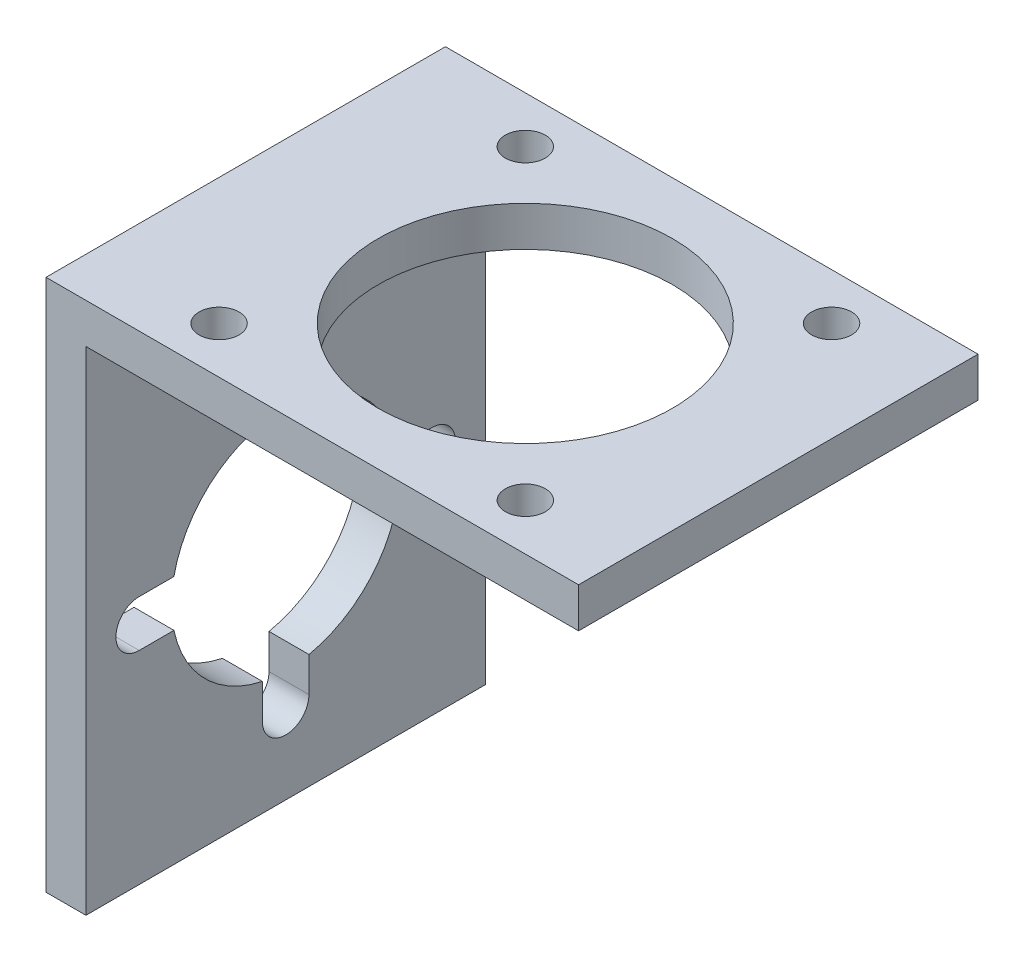
ISO-10303-21;
HEADER;
FILE_DESCRIPTION(('STEP AP214'),'2;1');
FILE_NAME('part.step','',(''),(''),'','','');
FILE_SCHEMA(('AUTOMOTIVE_DESIGN { 1 0 10303 214 1 1 1 1 }'));
ENDSEC;
DATA;
#1=APPLICATION_CONTEXT('core data for automotive mechanical design processes');
#2=APPLICATION_PROTOCOL_DEFINITION('international standard','automotive_design',2000,#1);
#3=PRODUCT_CONTEXT('',#1,'mechanical');
#4=PRODUCT('Part','Part','',(#3));
#5=PRODUCT_RELATED_PRODUCT_CATEGORY('part','',(#4));
#6=PRODUCT_DEFINITION_FORMATION('','',#4);
#7=PRODUCT_DEFINITION_CONTEXT('part definition',#1,'design');
#8=PRODUCT_DEFINITION('design','',#6,#7);
#9=PRODUCT_DEFINITION_SHAPE('','',#8);
#10=(LENGTH_UNIT() NAMED_UNIT(*) SI_UNIT(.MILLI.,.METRE.));
#11=(NAMED_UNIT(*) PLANE_ANGLE_UNIT() SI_UNIT($,.RADIAN.));
#12=(NAMED_UNIT(*) SI_UNIT($,.STERADIAN.) SOLID_ANGLE_UNIT());
#13=UNCERTAINTY_MEASURE_WITH_UNIT(LENGTH_MEASURE(1.E-05),#10,'distance_accuracy_value','');
#14=(GEOMETRIC_REPRESENTATION_CONTEXT(3) GLOBAL_UNCERTAINTY_ASSIGNED_CONTEXT((#13)) GLOBAL_UNIT_ASSIGNED_CONTEXT((#10,
#11,#12)) REPRESENTATION_CONTEXT('',''));
#15=CARTESIAN_POINT('',(0.,0.,0.));
#16=DIRECTION('',(0.,0.,1.));
#17=DIRECTION('',(1.,0.,0.));
#18=AXIS2_PLACEMENT_3D('',#15,#16,#17);
#19=CARTESIAN_POINT('',(0.,-3.,30.));
#20=DIRECTION('',(1.,0.,0.));
#21=DIRECTION('',(0.,1.,0.));
#22=AXIS2_PLACEMENT_3D('',#19,#20,#21);
#23=PLANE('',#22);
#24=DIRECTION('',(0.,0.,1.));
#25=VECTOR('',#24,1.);
#26=CARTESIAN_POINT('',(0.,-21.27,26.));
#27=LINE('',#26,#25);
#28=CARTESIAN_POINT('',(0.,-21.27,23.3894219109543));
#29=VERTEX_POINT('',#28);
#30=CARTESIAN_POINT('',(0.,-21.27,26.));
#31=VERTEX_POINT('',#30);
#32=EDGE_CURVE('E188',#29,#31,#27,.T.);
#33=ORIENTED_EDGE('',*,*,#32,.T.);
#34=CARTESIAN_POINT('',(0.,-23.02,26.));
#35=DIRECTION('',(1.,0.,0.));
#36=DIRECTION('',(0.,1.,0.));
#37=AXIS2_PLACEMENT_3D('',#34,#35,#36);
#38=CIRCLE('',#37,1.75);
#39=CARTESIAN_POINT('',(0.,-24.77,26.));
#40=VERTEX_POINT('',#39);
#41=EDGE_CURVE('E182',#31,#40,#38,.T.);
#42=ORIENTED_EDGE('',*,*,#41,.T.);
#43=DIRECTION('',(0.,0.,-1.));
#44=VECTOR('',#43,1.);
#45=CARTESIAN_POINT('',(0.,-24.77,26.));
#46=LINE('',#45,#44);
#47=CARTESIAN_POINT('',(0.,-24.77,23.3894219109543));
#48=VERTEX_POINT('',#47);
#49=EDGE_CURVE('E191',#40,#48,#46,.T.);
#50=ORIENTED_EDGE('',*,*,#49,.T.);
#51=CARTESIAN_POINT('',(0.,-23.02,15.));
#52=DIRECTION('',(1.,0.,0.));
#53=DIRECTION('',(0.,1.,0.));
#54=AXIS2_PLACEMENT_3D('',#51,#52,#53);
#55=CIRCLE('',#54,8.57);
#56=CARTESIAN_POINT('',(0.,-31.4094219109543,16.7499999999999));
#57=VERTEX_POINT('',#56);
#58=EDGE_CURVE('E46',#48,#57,#55,.T.);
#59=ORIENTED_EDGE('',*,*,#58,.T.);
#60=DIRECTION('',(0.,-1.,0.));
#61=VECTOR('',#60,1.);
#62=CARTESIAN_POINT('',(0.,-34.02,16.75));
#63=LINE('',#62,#61);
#64=CARTESIAN_POINT('',(0.,-34.02,16.75));
#65=VERTEX_POINT('',#64);
#66=EDGE_CURVE('E205',#57,#65,#63,.T.);
#67=ORIENTED_EDGE('',*,*,#66,.T.);
#68=CARTESIAN_POINT('',(0.,-34.02,15.));
#69=DIRECTION('',(1.,0.,0.));
#70=DIRECTION('',(0.,1.,0.));
#71=AXIS2_PLACEMENT_3D('',#68,#69,#70);
#72=CIRCLE('',#71,1.75);
#73=CARTESIAN_POINT('',(0.,-34.02,13.25));
#74=VERTEX_POINT('',#73);
#75=EDGE_CURVE('E208',#65,#74,#72,.T.);
#76=ORIENTED_EDGE('',*,*,#75,.T.);
#77=DIRECTION('',(0.,1.,0.));
#78=VECTOR('',#77,1.);
#79=CARTESIAN_POINT('',(0.,-34.02,13.25));
#80=LINE('',#79,#78);
#81=CARTESIAN_POINT('',(0.,-31.4094219109543,13.2499999999999));
#82=VERTEX_POINT('',#81);
#83=EDGE_CURVE('E211',#74,#82,#80,.T.);
#84=ORIENTED_EDGE('',*,*,#83,.T.);
#85=CARTESIAN_POINT('',(0.,-23.02,15.));
#86=DIRECTION('',(1.,0.,0.));
#87=DIRECTION('',(0.,1.,0.));
#88=AXIS2_PLACEMENT_3D('',#85,#86,#87);
#89=CIRCLE('',#88,8.57);
#90=CARTESIAN_POINT('',(0.,-24.77,6.6105780890457));
#91=VERTEX_POINT('',#90);
#92=EDGE_CURVE('E214',#82,#91,#89,.T.);
#93=ORIENTED_EDGE('',*,*,#92,.T.);
#94=DIRECTION('',(0.,0.,-1.));
#95=VECTOR('',#94,1.);
#96=CARTESIAN_POINT('',(0.,-24.7700000000001,4.00000000000001));
#97=LINE('',#96,#95);
#98=CARTESIAN_POINT('',(0.,-24.7700000000001,4.00000000000001));
#99=VERTEX_POINT('',#98);
#100=EDGE_CURVE('E217',#91,#99,#97,.T.);
#101=ORIENTED_EDGE('',*,*,#100,.T.);
#102=CARTESIAN_POINT('',(0.,-23.0200000000001,4.00000000000001));
#103=DIRECTION('',(1.,0.,0.));
#104=DIRECTION('',(0.,1.,0.));
#105=AXIS2_PLACEMENT_3D('',#102,#103,#104);
#106=CIRCLE('',#105,1.75);
#107=CARTESIAN_POINT('',(0.,-21.2700000000001,4.00000000000001));
#108=VERTEX_POINT('',#107);
#109=EDGE_CURVE('E220',#99,#108,#106,.T.);
#110=ORIENTED_EDGE('',*,*,#109,.T.);
#111=DIRECTION('',(0.,0.,1.));
#112=VECTOR('',#111,1.);
#113=CARTESIAN_POINT('',(0.,-21.2700000000001,4.00000000000001));
#114=LINE('',#113,#112);
#115=CARTESIAN_POINT('',(0.,-21.27,6.61057808904571));
#116=VERTEX_POINT('',#115);
#117=EDGE_CURVE('E223',#108,#116,#114,.T.);
#118=ORIENTED_EDGE('',*,*,#117,.T.);
#119=CARTESIAN_POINT('',(0.,-23.02,15.));
#120=DIRECTION('',(1.,0.,0.));
#121=DIRECTION('',(0.,1.,0.));
#122=AXIS2_PLACEMENT_3D('',#119,#120,#121);
#123=CIRCLE('',#122,8.57);
#124=CARTESIAN_POINT('',(0.,-14.6305780890457,13.2499999999999));
#125=VERTEX_POINT('',#124);
#126=EDGE_CURVE('E226',#116,#125,#123,.T.);
#127=ORIENTED_EDGE('',*,*,#126,.T.);
#128=DIRECTION('',(0.,1.,0.));
#129=VECTOR('',#128,1.);
#130=CARTESIAN_POINT('',(0.,-12.02,13.2499999999999));
#131=LINE('',#130,#129);
#132=CARTESIAN_POINT('',(0.,-12.02,13.2499999999999));
#133=VERTEX_POINT('',#132);
#134=EDGE_CURVE('E229',#125,#133,#131,.T.);
#135=ORIENTED_EDGE('',*,*,#134,.T.);
#136=CARTESIAN_POINT('',(0.,-12.02,14.9999999999999));
#137=DIRECTION('',(1.,0.,0.));
#138=DIRECTION('',(0.,1.,0.));
#139=AXIS2_PLACEMENT_3D('',#136,#137,#138);
#140=CIRCLE('',#139,1.75);
#141=CARTESIAN_POINT('',(0.,-12.02,16.7499999999999));
#142=VERTEX_POINT('',#141);
#143=EDGE_CURVE('E232',#133,#142,#140,.T.);
#144=ORIENTED_EDGE('',*,*,#143,.T.);
#145=DIRECTION('',(0.,-1.,0.));
#146=VECTOR('',#145,1.);
#147=CARTESIAN_POINT('',(0.,-12.02,16.7499999999999));
#148=LINE('',#147,#146);
#149=CARTESIAN_POINT('',(0.,-14.6305780890457,16.7499999999999));
#150=VERTEX_POINT('',#149);
#151=EDGE_CURVE('E235',#142,#150,#148,.T.);
#152=ORIENTED_EDGE('',*,*,#151,.T.);
#153=CARTESIAN_POINT('',(0.,-23.02,15.));
#154=DIRECTION('',(1.,0.,0.));
#155=DIRECTION('',(0.,1.,0.));
#156=AXIS2_PLACEMENT_3D('',#153,#154,#155);
#157=CIRCLE('',#156,8.57);
#158=EDGE_CURVE('E238',#150,#29,#157,.T.);
#159=ORIENTED_EDGE('',*,*,#158,.T.);
#160=EDGE_LOOP('',(#33,#42,#50,#59,#67,#76,#84,#93,#101,#110,#118,#127,#135,#144,#152,#159));
#161=FACE_BOUND('',#160,.T.);
#162=DIRECTION('',(0.,-1.,0.));
#163=VECTOR('',#162,1.);
#164=CARTESIAN_POINT('',(0.,-3.,0.));
#165=LINE('',#164,#163);
#166=CARTESIAN_POINT('',(0.,0.,0.));
#167=VERTEX_POINT('',#166);
#168=CARTESIAN_POINT('',(0.,-40.,0.));
#169=VERTEX_POINT('',#168);
#170=EDGE_CURVE('E339',#167,#169,#165,.T.);
#171=ORIENTED_EDGE('',*,*,#170,.T.);
#172=DIRECTION('',(0.,0.,-1.));
#173=VECTOR('',#172,1.);
#174=CARTESIAN_POINT('',(0.,-40.,30.));
#175=LINE('',#174,#173);
#176=CARTESIAN_POINT('',(0.,-40.,30.));
#177=VERTEX_POINT('',#176);
#178=EDGE_CURVE('E11',#177,#169,#175,.T.);
#179=ORIENTED_EDGE('',*,*,#178,.F.);
#180=DIRECTION('',(0.,-1.,0.));
#181=VECTOR('',#180,1.);
#182=CARTESIAN_POINT('',(0.,0.,30.));
#183=LINE('',#182,#181);
#184=CARTESIAN_POINT('',(0.,0.,30.));
#185=VERTEX_POINT('',#184);
#186=EDGE_CURVE('E342',#185,#177,#183,.T.);
#187=ORIENTED_EDGE('',*,*,#186,.F.);
#188=DIRECTION('',(0.,0.,-1.));
#189=VECTOR('',#188,1.);
#190=CARTESIAN_POINT('',(0.,0.,30.));
#191=LINE('',#190,#189);
#192=EDGE_CURVE('E355',#185,#167,#191,.T.);
#193=ORIENTED_EDGE('',*,*,#192,.T.);
#194=EDGE_LOOP('',(#171,#179,#187,#193));
#195=FACE_BOUND('',#194,.T.);
#196=ADVANCED_FACE('F32',(#161,#195),#23,.F.);
#197=CARTESIAN_POINT('',(0.,-40.,30.));
#198=DIRECTION('',(0.,1.,0.));
#199=DIRECTION('',(0.,0.,1.));
#200=AXIS2_PLACEMENT_3D('',#197,#198,#199);
#201=PLANE('',#200);
#202=DIRECTION('',(1.,0.,0.));
#203=VECTOR('',#202,1.);
#204=CARTESIAN_POINT('',(0.,-40.,0.));
#205=LINE('',#204,#203);
#206=CARTESIAN_POINT('',(3.00000000000001,-40.,0.));
#207=VERTEX_POINT('',#206);
#208=EDGE_CURVE('E357',#169,#207,#205,.T.);
#209=ORIENTED_EDGE('',*,*,#208,.T.);
#210=DIRECTION('',(0.,0.,-1.));
#211=VECTOR('',#210,1.);
#212=CARTESIAN_POINT('',(3.00000000000001,-40.,30.));
#213=LINE('',#212,#211);
#214=CARTESIAN_POINT('',(3.00000000000001,-40.,30.));
#215=VERTEX_POINT('',#214);
#216=EDGE_CURVE('E39',#215,#207,#213,.T.);
#217=ORIENTED_EDGE('',*,*,#216,.F.);
#218=DIRECTION('',(1.,0.,0.));
#219=VECTOR('',#218,1.);
#220=CARTESIAN_POINT('',(0.,-40.,30.));
#221=LINE('',#220,#219);
#222=EDGE_CURVE('E344',#177,#215,#221,.T.);
#223=ORIENTED_EDGE('',*,*,#222,.F.);
#224=ORIENTED_EDGE('',*,*,#178,.T.);
#225=EDGE_LOOP('',(#209,#217,#223,#224));
#226=FACE_BOUND('',#225,.T.);
#227=ADVANCED_FACE('F406',(#226),#201,.F.);
#228=CARTESIAN_POINT('',(3.,-3.,30.));
#229=DIRECTION('',(-1.,0.,0.));
#230=DIRECTION('',(0.,-1.,0.));
#231=AXIS2_PLACEMENT_3D('',#228,#229,#230);
#232=PLANE('',#231);
#233=DIRECTION('',(0.,0.,-1.));
#234=VECTOR('',#233,1.);
#235=CARTESIAN_POINT('',(3.,-24.77,26.));
#236=LINE('',#235,#234);
#237=CARTESIAN_POINT('',(3.,-24.77,26.));
#238=VERTEX_POINT('',#237);
#239=CARTESIAN_POINT('',(3.,-24.77,23.3894219109543));
#240=VERTEX_POINT('',#239);
#241=EDGE_CURVE('E242',#238,#240,#236,.T.);
#242=ORIENTED_EDGE('',*,*,#241,.F.);
#243=CARTESIAN_POINT('',(3.,-23.02,26.));
#244=DIRECTION('',(1.,0.,0.));
#245=DIRECTION('',(0.,1.,0.));
#246=AXIS2_PLACEMENT_3D('',#243,#244,#245);
#247=CIRCLE('',#246,1.75);
#248=CARTESIAN_POINT('',(3.,-21.27,26.));
#249=VERTEX_POINT('',#248);
#250=EDGE_CURVE('E54',#249,#238,#247,.T.);
#251=ORIENTED_EDGE('',*,*,#250,.F.);
#252=DIRECTION('',(0.,0.,1.));
#253=VECTOR('',#252,1.);
#254=CARTESIAN_POINT('',(3.,-21.27,26.));
#255=LINE('',#254,#253);
#256=CARTESIAN_POINT('',(3.,-21.27,23.3894219109543));
#257=VERTEX_POINT('',#256);
#258=EDGE_CURVE('E198',#257,#249,#255,.T.);
#259=ORIENTED_EDGE('',*,*,#258,.F.);
#260=CARTESIAN_POINT('',(3.,-23.02,15.));
#261=DIRECTION('',(1.,0.,0.));
#262=DIRECTION('',(0.,1.,0.));
#263=AXIS2_PLACEMENT_3D('',#260,#261,#262);
#264=CIRCLE('',#263,8.57);
#265=CARTESIAN_POINT('',(3.,-14.6305780890457,16.7499999999999));
#266=VERTEX_POINT('',#265);
#267=EDGE_CURVE('E201',#266,#257,#264,.T.);
#268=ORIENTED_EDGE('',*,*,#267,.F.);
#269=DIRECTION('',(0.,-1.,0.));
#270=VECTOR('',#269,1.);
#271=CARTESIAN_POINT('',(3.,-12.02,16.7499999999999));
#272=LINE('',#271,#270);
#273=CARTESIAN_POINT('',(3.,-12.02,16.7499999999999));
#274=VERTEX_POINT('',#273);
#275=EDGE_CURVE('E277',#274,#266,#272,.T.);
#276=ORIENTED_EDGE('',*,*,#275,.F.);
#277=CARTESIAN_POINT('',(3.,-12.02,14.9999999999999));
#278=DIRECTION('',(1.,0.,0.));
#279=DIRECTION('',(0.,1.,0.));
#280=AXIS2_PLACEMENT_3D('',#277,#278,#279);
#281=CIRCLE('',#280,1.75);
#282=CARTESIAN_POINT('',(3.,-12.02,13.2499999999999));
#283=VERTEX_POINT('',#282);
#284=EDGE_CURVE('E274',#283,#274,#281,.T.);
#285=ORIENTED_EDGE('',*,*,#284,.F.);
#286=DIRECTION('',(0.,1.,0.));
#287=VECTOR('',#286,1.);
#288=CARTESIAN_POINT('',(3.,-12.02,13.2499999999999));
#289=LINE('',#288,#287);
#290=CARTESIAN_POINT('',(3.,-14.6305780890457,13.2499999999999));
#291=VERTEX_POINT('',#290);
#292=EDGE_CURVE('E271',#291,#283,#289,.T.);
#293=ORIENTED_EDGE('',*,*,#292,.F.);
#294=CARTESIAN_POINT('',(3.,-23.02,15.));
#295=DIRECTION('',(1.,0.,0.));
#296=DIRECTION('',(0.,1.,0.));
#297=AXIS2_PLACEMENT_3D('',#294,#295,#296);
#298=CIRCLE('',#297,8.57);
#299=CARTESIAN_POINT('',(3.,-21.27,6.61057808904571));
#300=VERTEX_POINT('',#299);
#301=EDGE_CURVE('E268',#300,#291,#298,.T.);
#302=ORIENTED_EDGE('',*,*,#301,.F.);
#303=DIRECTION('',(0.,0.,1.));
#304=VECTOR('',#303,1.);
#305=CARTESIAN_POINT('',(3.,-21.2700000000001,4.00000000000001));
#306=LINE('',#305,#304);
#307=CARTESIAN_POINT('',(3.,-21.2700000000001,4.00000000000001));
#308=VERTEX_POINT('',#307);
#309=EDGE_CURVE('E265',#308,#300,#306,.T.);
#310=ORIENTED_EDGE('',*,*,#309,.F.);
#311=CARTESIAN_POINT('',(3.,-23.0200000000001,4.00000000000001));
#312=DIRECTION('',(1.,0.,0.));
#313=DIRECTION('',(0.,1.,0.));
#314=AXIS2_PLACEMENT_3D('',#311,#312,#313);
#315=CIRCLE('',#314,1.75);
#316=CARTESIAN_POINT('',(3.,-24.7700000000001,4.00000000000001));
#317=VERTEX_POINT('',#316);
#318=EDGE_CURVE('E262',#317,#308,#315,.T.);
#319=ORIENTED_EDGE('',*,*,#318,.F.);
#320=DIRECTION('',(0.,0.,-1.));
#321=VECTOR('',#320,1.);
#322=CARTESIAN_POINT('',(3.,-24.7700000000001,4.00000000000001));
#323=LINE('',#322,#321);
#324=CARTESIAN_POINT('',(3.,-24.77,6.6105780890457));
#325=VERTEX_POINT('',#324);
#326=EDGE_CURVE('E259',#325,#317,#323,.T.);
#327=ORIENTED_EDGE('',*,*,#326,.F.);
#328=CARTESIAN_POINT('',(3.,-23.02,15.));
#329=DIRECTION('',(1.,0.,0.));
#330=DIRECTION('',(0.,1.,0.));
#331=AXIS2_PLACEMENT_3D('',#328,#329,#330);
#332=CIRCLE('',#331,8.57);
#333=CARTESIAN_POINT('',(3.,-31.4094219109543,13.2499999999999));
#334=VERTEX_POINT('',#333);
#335=EDGE_CURVE('E256',#334,#325,#332,.T.);
#336=ORIENTED_EDGE('',*,*,#335,.F.);
#337=DIRECTION('',(0.,1.,0.));
#338=VECTOR('',#337,1.);
#339=CARTESIAN_POINT('',(3.,-34.02,13.25));
#340=LINE('',#339,#338);
#341=CARTESIAN_POINT('',(3.,-34.02,13.25));
#342=VERTEX_POINT('',#341);
#343=EDGE_CURVE('E253',#342,#334,#340,.T.);
#344=ORIENTED_EDGE('',*,*,#343,.F.);
#345=CARTESIAN_POINT('',(3.,-34.02,15.));
#346=DIRECTION('',(1.,0.,0.));
#347=DIRECTION('',(0.,1.,0.));
#348=AXIS2_PLACEMENT_3D('',#345,#346,#347);
#349=CIRCLE('',#348,1.75);
#350=CARTESIAN_POINT('',(3.,-34.02,16.75));
#351=VERTEX_POINT('',#350);
#352=EDGE_CURVE('E250',#351,#342,#349,.T.);
#353=ORIENTED_EDGE('',*,*,#352,.F.);
#354=DIRECTION('',(0.,-1.,0.));
#355=VECTOR('',#354,1.);
#356=CARTESIAN_POINT('',(3.,-34.02,16.75));
#357=LINE('',#356,#355);
#358=CARTESIAN_POINT('',(3.,-31.4094219109543,16.7499999999999));
#359=VERTEX_POINT('',#358);
#360=EDGE_CURVE('E247',#359,#351,#357,.T.);
#361=ORIENTED_EDGE('',*,*,#360,.F.);
#362=CARTESIAN_POINT('',(3.,-23.02,15.));
#363=DIRECTION('',(1.,0.,0.));
#364=DIRECTION('',(0.,1.,0.));
#365=AXIS2_PLACEMENT_3D('',#362,#363,#364);
#366=CIRCLE('',#365,8.57);
#367=EDGE_CURVE('E244',#240,#359,#366,.T.);
#368=ORIENTED_EDGE('',*,*,#367,.F.);
#369=EDGE_LOOP('',(#242,#251,#259,#268,#276,#285,#293,#302,#310,#319,#327,#336,#344,#353,#361,#368));
#370=FACE_BOUND('',#369,.T.);
#371=DIRECTION('',(0.,1.,0.));
#372=VECTOR('',#371,1.);
#373=CARTESIAN_POINT('',(3.,-3.,0.));
#374=LINE('',#373,#372);
#375=CARTESIAN_POINT('',(3.,-3.,0.));
#376=VERTEX_POINT('',#375);
#377=EDGE_CURVE('E359',#207,#376,#374,.T.);
#378=ORIENTED_EDGE('',*,*,#377,.T.);
#379=DIRECTION('',(0.,0.,-1.));
#380=VECTOR('',#379,1.);
#381=CARTESIAN_POINT('',(3.,-3.,30.));
#382=LINE('',#381,#380);
#383=CARTESIAN_POINT('',(3.,-3.,30.));
#384=VERTEX_POINT('',#383);
#385=EDGE_CURVE('E375',#384,#376,#382,.T.);
#386=ORIENTED_EDGE('',*,*,#385,.F.);
#387=DIRECTION('',(0.,1.,0.));
#388=VECTOR('',#387,1.);
#389=CARTESIAN_POINT('',(3.,-3.,30.));
#390=LINE('',#389,#388);
#391=EDGE_CURVE('E347',#215,#384,#390,.T.);
#392=ORIENTED_EDGE('',*,*,#391,.F.);
#393=ORIENTED_EDGE('',*,*,#216,.T.);
#394=EDGE_LOOP('',(#378,#386,#392,#393));
#395=FACE_BOUND('',#394,.T.);
#396=ADVANCED_FACE('F382',(#370,#395),#232,.F.);
#397=CARTESIAN_POINT('',(3.,-3.,30.));
#398=DIRECTION('',(0.,1.,0.));
#399=DIRECTION('',(0.,0.,1.));
#400=AXIS2_PLACEMENT_3D('',#397,#398,#399);
#401=PLANE('',#400);
#402=CARTESIAN_POINT('',(9.50000000000012,-3.,26.5021834883641));
#403=DIRECTION('',(0.,-1.,0.));
#404=DIRECTION('',(0.,0.,-1.));
#405=AXIS2_PLACEMENT_3D('',#402,#403,#404);
#406=CIRCLE('',#405,1.50000000000001);
#407=CARTESIAN_POINT('',(9.50000000000012,-3.,25.0021834883641));
#408=VERTEX_POINT('',#407);
#409=EDGE_CURVE('E284',#408,#408,#406,.T.);
#410=ORIENTED_EDGE('',*,*,#409,.F.);
#411=EDGE_LOOP('',(#410));
#412=FACE_BOUND('',#411,.T.);
#413=CARTESIAN_POINT('',(9.49781651163593,-3.,3.49999999999975));
#414=DIRECTION('',(0.,-1.,0.));
#415=DIRECTION('',(0.,0.,-1.));
#416=AXIS2_PLACEMENT_3D('',#413,#414,#415);
#417=CIRCLE('',#416,1.5);
#418=CARTESIAN_POINT('',(9.49781651163593,-3.,1.99999999999975));
#419=VERTEX_POINT('',#418);
#420=EDGE_CURVE('E315',#419,#419,#417,.T.);
#421=ORIENTED_EDGE('',*,*,#420,.F.);
#422=EDGE_LOOP('',(#421));
#423=FACE_BOUND('',#422,.T.);
#424=CARTESIAN_POINT('',(32.5000000000003,-3.,3.49781651163567));
#425=DIRECTION('',(0.,-1.,0.));
#426=DIRECTION('',(0.,0.,-1.));
#427=AXIS2_PLACEMENT_3D('',#424,#425,#426);
#428=CIRCLE('',#427,1.50000000000001);
#429=CARTESIAN_POINT('',(32.5000000000003,-3.,1.99781651163566));
#430=VERTEX_POINT('',#429);
#431=EDGE_CURVE('E321',#430,#430,#428,.T.);
#432=ORIENTED_EDGE('',*,*,#431,.F.);
#433=EDGE_LOOP('',(#432));
#434=FACE_BOUND('',#433,.T.);
#435=CARTESIAN_POINT('',(32.5021834883643,-3.,26.5));
#436=DIRECTION('',(0.,-1.,0.));
#437=DIRECTION('',(0.,0.,-1.));
#438=AXIS2_PLACEMENT_3D('',#435,#436,#437);
#439=CIRCLE('',#438,1.5);
#440=CARTESIAN_POINT('',(32.5021834883643,-3.,25.));
#441=VERTEX_POINT('',#440);
#442=EDGE_CURVE('E327',#441,#441,#439,.T.);
#443=ORIENTED_EDGE('',*,*,#442,.F.);
#444=EDGE_LOOP('',(#443));
#445=FACE_BOUND('',#444,.T.);
#446=CARTESIAN_POINT('',(21.,-3.,15.));
#447=DIRECTION('',(0.,-1.,0.));
#448=DIRECTION('',(0.,0.,-1.));
#449=AXIS2_PLACEMENT_3D('',#446,#447,#448);
#450=CIRCLE('',#449,11.05);
#451=CARTESIAN_POINT('',(21.,-3.,3.95));
#452=VERTEX_POINT('',#451);
#453=EDGE_CURVE('E333',#452,#452,#450,.T.);
#454=ORIENTED_EDGE('',*,*,#453,.F.);
#455=EDGE_LOOP('',(#454));
#456=FACE_BOUND('',#455,.T.);
#457=DIRECTION('',(1.,0.,0.));
#458=VECTOR('',#457,1.);
#459=CARTESIAN_POINT('',(3.,-3.,0.));
#460=LINE('',#459,#458);
#461=CARTESIAN_POINT('',(40.,-3.,0.));
#462=VERTEX_POINT('',#461);
#463=EDGE_CURVE('E361',#376,#462,#460,.T.);
#464=ORIENTED_EDGE('',*,*,#463,.T.);
#465=DIRECTION('',(0.,0.,-1.));
#466=VECTOR('',#465,1.);
#467=CARTESIAN_POINT('',(40.,-3.,30.));
#468=LINE('',#467,#466);
#469=CARTESIAN_POINT('',(40.,-3.,30.));
#470=VERTEX_POINT('',#469);
#471=EDGE_CURVE('E372',#470,#462,#468,.T.);
#472=ORIENTED_EDGE('',*,*,#471,.F.);
#473=DIRECTION('',(1.,0.,0.));
#474=VECTOR('',#473,1.);
#475=CARTESIAN_POINT('',(3.,-3.,30.));
#476=LINE('',#475,#474);
#477=EDGE_CURVE('E349',#384,#470,#476,.T.);
#478=ORIENTED_EDGE('',*,*,#477,.F.);
#479=ORIENTED_EDGE('',*,*,#385,.T.);
#480=EDGE_LOOP('',(#464,#472,#478,#479));
#481=FACE_BOUND('',#480,.T.);
#482=ADVANCED_FACE('F394',(#412,#423,#434,#445,#456,#481),#401,.F.);
#483=CARTESIAN_POINT('',(40.,0.,30.));
#484=DIRECTION('',(-1.,0.,0.));
#485=DIRECTION('',(0.,0.,1.));
#486=AXIS2_PLACEMENT_3D('',#483,#484,#485);
#487=PLANE('',#486);
#488=DIRECTION('',(0.,1.,0.));
#489=VECTOR('',#488,1.);
#490=CARTESIAN_POINT('',(40.,0.,0.));
#491=LINE('',#490,#489);
#492=CARTESIAN_POINT('',(40.,0.,0.));
#493=VERTEX_POINT('',#492);
#494=EDGE_CURVE('E363',#462,#493,#491,.T.);
#495=ORIENTED_EDGE('',*,*,#494,.T.);
#496=DIRECTION('',(0.,0.,-1.));
#497=VECTOR('',#496,1.);
#498=CARTESIAN_POINT('',(40.,0.,30.));
#499=LINE('',#498,#497);
#500=CARTESIAN_POINT('',(40.,0.,30.));
#501=VERTEX_POINT('',#500);
#502=EDGE_CURVE('E369',#501,#493,#499,.T.);
#503=ORIENTED_EDGE('',*,*,#502,.F.);
#504=DIRECTION('',(0.,1.,0.));
#505=VECTOR('',#504,1.);
#506=CARTESIAN_POINT('',(40.,0.,30.));
#507=LINE('',#506,#505);
#508=EDGE_CURVE('E351',#470,#501,#507,.T.);
#509=ORIENTED_EDGE('',*,*,#508,.F.);
#510=ORIENTED_EDGE('',*,*,#471,.T.);
#511=EDGE_LOOP('',(#495,#503,#509,#510));
#512=FACE_BOUND('',#511,.T.);
#513=ADVANCED_FACE('F398',(#512),#487,.F.);
#514=CARTESIAN_POINT('',(0.,0.,30.));
#515=DIRECTION('',(0.,-1.,0.));
#516=DIRECTION('',(0.,0.,-1.));
#517=AXIS2_PLACEMENT_3D('',#514,#515,#516);
#518=PLANE('',#517);
#519=CARTESIAN_POINT('',(9.50000000000012,0.,26.5021834883641));
#520=DIRECTION('',(0.,-1.,0.));
#521=DIRECTION('',(0.,0.,-1.));
#522=AXIS2_PLACEMENT_3D('',#519,#520,#521);
#523=CIRCLE('',#522,1.50000000000001);
#524=CARTESIAN_POINT('',(9.50000000000012,0.,25.0021834883641));
#525=VERTEX_POINT('',#524);
#526=EDGE_CURVE('E312',#525,#525,#523,.T.);
#527=ORIENTED_EDGE('',*,*,#526,.T.);
#528=EDGE_LOOP('',(#527));
#529=FACE_BOUND('',#528,.T.);
#530=CARTESIAN_POINT('',(9.49781651163593,0.,3.49999999999975));
#531=DIRECTION('',(0.,-1.,0.));
#532=DIRECTION('',(0.,0.,-1.));
#533=AXIS2_PLACEMENT_3D('',#530,#531,#532);
#534=CIRCLE('',#533,1.5);
#535=CARTESIAN_POINT('',(9.49781651163593,0.,1.99999999999975));
#536=VERTEX_POINT('',#535);
#537=EDGE_CURVE('E318',#536,#536,#534,.T.);
#538=ORIENTED_EDGE('',*,*,#537,.T.);
#539=EDGE_LOOP('',(#538));
#540=FACE_BOUND('',#539,.T.);
#541=CARTESIAN_POINT('',(32.5000000000003,0.,3.49781651163567));
#542=DIRECTION('',(0.,-1.,0.));
#543=DIRECTION('',(0.,0.,-1.));
#544=AXIS2_PLACEMENT_3D('',#541,#542,#543);
#545=CIRCLE('',#544,1.50000000000001);
#546=CARTESIAN_POINT('',(32.5000000000003,0.,1.99781651163566));
#547=VERTEX_POINT('',#546);
#548=EDGE_CURVE('E324',#547,#547,#545,.T.);
#549=ORIENTED_EDGE('',*,*,#548,.T.);
#550=EDGE_LOOP('',(#549));
#551=FACE_BOUND('',#550,.T.);
#552=CARTESIAN_POINT('',(32.5021834883643,0.,26.5));
#553=DIRECTION('',(0.,-1.,0.));
#554=DIRECTION('',(0.,0.,-1.));
#555=AXIS2_PLACEMENT_3D('',#552,#553,#554);
#556=CIRCLE('',#555,1.5);
#557=CARTESIAN_POINT('',(32.5021834883643,0.,25.));
#558=VERTEX_POINT('',#557);
#559=EDGE_CURVE('E330',#558,#558,#556,.T.);
#560=ORIENTED_EDGE('',*,*,#559,.T.);
#561=EDGE_LOOP('',(#560));
#562=FACE_BOUND('',#561,.T.);
#563=CARTESIAN_POINT('',(21.,0.,15.));
#564=DIRECTION('',(0.,-1.,0.));
#565=DIRECTION('',(0.,0.,-1.));
#566=AXIS2_PLACEMENT_3D('',#563,#564,#565);
#567=CIRCLE('',#566,11.05);
#568=CARTESIAN_POINT('',(21.,0.,3.95));
#569=VERTEX_POINT('',#568);
#570=EDGE_CURVE('E336',#569,#569,#567,.T.);
#571=ORIENTED_EDGE('',*,*,#570,.T.);
#572=EDGE_LOOP('',(#571));
#573=FACE_BOUND('',#572,.T.);
#574=DIRECTION('',(-1.,0.,0.));
#575=VECTOR('',#574,1.);
#576=CARTESIAN_POINT('',(0.,0.,0.));
#577=LINE('',#576,#575);
#578=EDGE_CURVE('E345',#493,#167,#577,.T.);
#579=ORIENTED_EDGE('',*,*,#578,.T.);
#580=ORIENTED_EDGE('',*,*,#192,.F.);
#581=DIRECTION('',(-1.,0.,0.));
#582=VECTOR('',#581,1.);
#583=CARTESIAN_POINT('',(0.,0.,30.));
#584=LINE('',#583,#582);
#585=EDGE_CURVE('E353',#501,#185,#584,.T.);
#586=ORIENTED_EDGE('',*,*,#585,.F.);
#587=ORIENTED_EDGE('',*,*,#502,.T.);
#588=EDGE_LOOP('',(#579,#580,#586,#587));
#589=FACE_BOUND('',#588,.T.);
#590=ADVANCED_FACE('F408',(#529,#540,#551,#562,#573,#589),#518,.F.);
#591=CARTESIAN_POINT('',(0.,0.,30.));
#592=DIRECTION('',(0.,0.,1.));
#593=DIRECTION('',(1.,0.,0.));
#594=AXIS2_PLACEMENT_3D('',#591,#592,#593);
#595=PLANE('',#594);
#596=ORIENTED_EDGE('',*,*,#186,.T.);
#597=ORIENTED_EDGE('',*,*,#222,.T.);
#598=ORIENTED_EDGE('',*,*,#391,.T.);
#599=ORIENTED_EDGE('',*,*,#477,.T.);
#600=ORIENTED_EDGE('',*,*,#508,.T.);
#601=ORIENTED_EDGE('',*,*,#585,.T.);
#602=EDGE_LOOP('',(#596,#597,#598,#599,#600,#601));
#603=FACE_BOUND('',#602,.T.);
#604=ADVANCED_FACE('F402',(#603),#595,.T.);
#605=CARTESIAN_POINT('',(0.,0.,0.));
#606=DIRECTION('',(0.,0.,1.));
#607=DIRECTION('',(1.,0.,0.));
#608=AXIS2_PLACEMENT_3D('',#605,#606,#607);
#609=PLANE('',#608);
#610=ORIENTED_EDGE('',*,*,#170,.F.);
#611=ORIENTED_EDGE('',*,*,#578,.F.);
#612=ORIENTED_EDGE('',*,*,#494,.F.);
#613=ORIENTED_EDGE('',*,*,#463,.F.);
#614=ORIENTED_EDGE('',*,*,#377,.F.);
#615=ORIENTED_EDGE('',*,*,#208,.F.);
#616=EDGE_LOOP('',(#610,#611,#612,#613,#614,#615));
#617=FACE_BOUND('',#616,.T.);
#618=ADVANCED_FACE('F389',(#617),#609,.F.);
#619=CARTESIAN_POINT('',(21.,0.,15.));
#620=DIRECTION('',(0.,-1.,0.));
#621=DIRECTION('',(0.,0.,-1.));
#622=AXIS2_PLACEMENT_3D('',#619,#620,#621);
#623=CYLINDRICAL_SURFACE('',#622,11.05);
#624=ORIENTED_EDGE('',*,*,#570,.F.);
#625=EDGE_LOOP('',(#624));
#626=FACE_BOUND('',#625,.T.);
#627=ORIENTED_EDGE('',*,*,#453,.T.);
#628=EDGE_LOOP('',(#627));
#629=FACE_BOUND('',#628,.T.);
#630=ADVANCED_FACE('F444',(#626,#629),#623,.F.);
#631=CARTESIAN_POINT('',(32.5021834883643,0.,26.5));
#632=DIRECTION('',(0.,-1.,0.));
#633=DIRECTION('',(0.,0.,-1.));
#634=AXIS2_PLACEMENT_3D('',#631,#632,#633);
#635=CYLINDRICAL_SURFACE('',#634,1.5);
#636=ORIENTED_EDGE('',*,*,#559,.F.);
#637=EDGE_LOOP('',(#636));
#638=FACE_BOUND('',#637,.T.);
#639=ORIENTED_EDGE('',*,*,#442,.T.);
#640=EDGE_LOOP('',(#639));
#641=FACE_BOUND('',#640,.T.);
#642=ADVANCED_FACE('F446',(#638,#641),#635,.F.);
#643=CARTESIAN_POINT('',(32.5000000000003,0.,3.49781651163567));
#644=DIRECTION('',(0.,-1.,0.));
#645=DIRECTION('',(0.,0.,-1.));
#646=AXIS2_PLACEMENT_3D('',#643,#644,#645);
#647=CYLINDRICAL_SURFACE('',#646,1.50000000000001);
#648=ORIENTED_EDGE('',*,*,#548,.F.);
#649=EDGE_LOOP('',(#648));
#650=FACE_BOUND('',#649,.T.);
#651=ORIENTED_EDGE('',*,*,#431,.T.);
#652=EDGE_LOOP('',(#651));
#653=FACE_BOUND('',#652,.T.);
#654=ADVANCED_FACE('F453',(#650,#653),#647,.F.);
#655=CARTESIAN_POINT('',(9.49781651163593,0.,3.49999999999975));
#656=DIRECTION('',(0.,-1.,0.));
#657=DIRECTION('',(0.,0.,-1.));
#658=AXIS2_PLACEMENT_3D('',#655,#656,#657);
#659=CYLINDRICAL_SURFACE('',#658,1.5);
#660=ORIENTED_EDGE('',*,*,#537,.F.);
#661=EDGE_LOOP('',(#660));
#662=FACE_BOUND('',#661,.T.);
#663=ORIENTED_EDGE('',*,*,#420,.T.);
#664=EDGE_LOOP('',(#663));
#665=FACE_BOUND('',#664,.T.);
#666=ADVANCED_FACE('F460',(#662,#665),#659,.F.);
#667=CARTESIAN_POINT('',(9.50000000000012,0.,26.5021834883641));
#668=DIRECTION('',(0.,-1.,0.));
#669=DIRECTION('',(0.,0.,-1.));
#670=AXIS2_PLACEMENT_3D('',#667,#668,#669);
#671=CYLINDRICAL_SURFACE('',#670,1.50000000000001);
#672=ORIENTED_EDGE('',*,*,#526,.F.);
#673=EDGE_LOOP('',(#672));
#674=FACE_BOUND('',#673,.T.);
#675=ORIENTED_EDGE('',*,*,#409,.T.);
#676=EDGE_LOOP('',(#675));
#677=FACE_BOUND('',#676,.T.);
#678=ADVANCED_FACE('F464',(#674,#677),#671,.F.);
#679=CARTESIAN_POINT('',(0.,-23.02,26.));
#680=DIRECTION('',(1.,0.,0.));
#681=DIRECTION('',(0.,1.,0.));
#682=AXIS2_PLACEMENT_3D('',#679,#680,#681);
#683=CYLINDRICAL_SURFACE('',#682,1.75);
#684=ORIENTED_EDGE('',*,*,#250,.T.);
#685=DIRECTION('',(1.,0.,0.));
#686=VECTOR('',#685,1.);
#687=CARTESIAN_POINT('',(0.,-24.77,26.));
#688=LINE('',#687,#686);
#689=EDGE_CURVE('E178',#40,#238,#688,.T.);
#690=ORIENTED_EDGE('',*,*,#689,.F.);
#691=ORIENTED_EDGE('',*,*,#41,.F.);
#692=DIRECTION('',(1.,0.,0.));
#693=VECTOR('',#692,1.);
#694=CARTESIAN_POINT('',(0.,-21.27,26.));
#695=LINE('',#694,#693);
#696=EDGE_CURVE('E282',#31,#249,#695,.T.);
#697=ORIENTED_EDGE('',*,*,#696,.T.);
#698=EDGE_LOOP('',(#684,#690,#691,#697));
#699=FACE_BOUND('',#698,.T.);
#700=ADVANCED_FACE('F180',(#699),#683,.F.);
#701=CARTESIAN_POINT('',(0.,-21.27,26.));
#702=DIRECTION('',(0.,1.,0.));
#703=DIRECTION('',(-1.,0.,0.));
#704=AXIS2_PLACEMENT_3D('',#701,#702,#703);
#705=PLANE('',#704);
#706=ORIENTED_EDGE('',*,*,#258,.T.);
#707=ORIENTED_EDGE('',*,*,#696,.F.);
#708=ORIENTED_EDGE('',*,*,#32,.F.);
#709=DIRECTION('',(1.,0.,0.));
#710=VECTOR('',#709,1.);
#711=CARTESIAN_POINT('',(0.,-21.27,23.3894219109543));
#712=LINE('',#711,#710);
#713=EDGE_CURVE('E285',#29,#257,#712,.T.);
#714=ORIENTED_EDGE('',*,*,#713,.T.);
#715=EDGE_LOOP('',(#706,#707,#708,#714));
#716=FACE_BOUND('',#715,.T.);
#717=ADVANCED_FACE('F471',(#716),#705,.F.);
#718=CARTESIAN_POINT('',(0.,-23.02,15.));
#719=DIRECTION('',(1.,0.,0.));
#720=DIRECTION('',(0.,1.,0.));
#721=AXIS2_PLACEMENT_3D('',#718,#719,#720);
#722=CYLINDRICAL_SURFACE('',#721,8.57);
#723=ORIENTED_EDGE('',*,*,#267,.T.);
#724=ORIENTED_EDGE('',*,*,#713,.F.);
#725=ORIENTED_EDGE('',*,*,#158,.F.);
#726=DIRECTION('',(1.,0.,0.));
#727=VECTOR('',#726,1.);
#728=CARTESIAN_POINT('',(0.,-14.6305780890457,16.7499999999999));
#729=LINE('',#728,#727);
#730=EDGE_CURVE('E287',#150,#266,#729,.T.);
#731=ORIENTED_EDGE('',*,*,#730,.T.);
#732=EDGE_LOOP('',(#723,#724,#725,#731));
#733=FACE_BOUND('',#732,.T.);
#734=ADVANCED_FACE('F520',(#733),#722,.F.);
#735=CARTESIAN_POINT('',(0.,-12.02,16.7499999999999));
#736=DIRECTION('',(0.,0.,1.));
#737=DIRECTION('',(1.,0.,0.));
#738=AXIS2_PLACEMENT_3D('',#735,#736,#737);
#739=PLANE('',#738);
#740=ORIENTED_EDGE('',*,*,#275,.T.);
#741=ORIENTED_EDGE('',*,*,#730,.F.);
#742=ORIENTED_EDGE('',*,*,#151,.F.);
#743=DIRECTION('',(1.,0.,0.));
#744=VECTOR('',#743,1.);
#745=CARTESIAN_POINT('',(0.,-12.02,16.7499999999999));
#746=LINE('',#745,#744);
#747=EDGE_CURVE('E289',#142,#274,#746,.T.);
#748=ORIENTED_EDGE('',*,*,#747,.T.);
#749=EDGE_LOOP('',(#740,#741,#742,#748));
#750=FACE_BOUND('',#749,.T.);
#751=ADVANCED_FACE('F516',(#750),#739,.F.);
#752=CARTESIAN_POINT('',(0.,-12.02,14.9999999999999));
#753=DIRECTION('',(1.,0.,0.));
#754=DIRECTION('',(0.,1.,0.));
#755=AXIS2_PLACEMENT_3D('',#752,#753,#754);
#756=CYLINDRICAL_SURFACE('',#755,1.75);
#757=ORIENTED_EDGE('',*,*,#284,.T.);
#758=ORIENTED_EDGE('',*,*,#747,.F.);
#759=ORIENTED_EDGE('',*,*,#143,.F.);
#760=DIRECTION('',(1.,0.,0.));
#761=VECTOR('',#760,1.);
#762=CARTESIAN_POINT('',(0.,-12.02,13.2499999999999));
#763=LINE('',#762,#761);
#764=EDGE_CURVE('E291',#133,#283,#763,.T.);
#765=ORIENTED_EDGE('',*,*,#764,.T.);
#766=EDGE_LOOP('',(#757,#758,#759,#765));
#767=FACE_BOUND('',#766,.T.);
#768=ADVANCED_FACE('F512',(#767),#756,.F.);
#769=CARTESIAN_POINT('',(0.,-12.02,13.2499999999999));
#770=DIRECTION('',(0.,0.,-1.));
#771=DIRECTION('',(-1.,0.,0.));
#772=AXIS2_PLACEMENT_3D('',#769,#770,#771);
#773=PLANE('',#772);
#774=ORIENTED_EDGE('',*,*,#292,.T.);
#775=ORIENTED_EDGE('',*,*,#764,.F.);
#776=ORIENTED_EDGE('',*,*,#134,.F.);
#777=DIRECTION('',(1.,0.,0.));
#778=VECTOR('',#777,1.);
#779=CARTESIAN_POINT('',(0.,-14.6305780890457,13.2499999999999));
#780=LINE('',#779,#778);
#781=EDGE_CURVE('E293',#125,#291,#780,.T.);
#782=ORIENTED_EDGE('',*,*,#781,.T.);
#783=EDGE_LOOP('',(#774,#775,#776,#782));
#784=FACE_BOUND('',#783,.T.);
#785=ADVANCED_FACE('F508',(#784),#773,.F.);
#786=CARTESIAN_POINT('',(0.,-23.02,15.));
#787=DIRECTION('',(1.,0.,0.));
#788=DIRECTION('',(0.,1.,0.));
#789=AXIS2_PLACEMENT_3D('',#786,#787,#788);
#790=CYLINDRICAL_SURFACE('',#789,8.57);
#791=ORIENTED_EDGE('',*,*,#301,.T.);
#792=ORIENTED_EDGE('',*,*,#781,.F.);
#793=ORIENTED_EDGE('',*,*,#126,.F.);
#794=DIRECTION('',(1.,0.,0.));
#795=VECTOR('',#794,1.);
#796=CARTESIAN_POINT('',(0.,-21.27,6.61057808904571));
#797=LINE('',#796,#795);
#798=EDGE_CURVE('E295',#116,#300,#797,.T.);
#799=ORIENTED_EDGE('',*,*,#798,.T.);
#800=EDGE_LOOP('',(#791,#792,#793,#799));
#801=FACE_BOUND('',#800,.T.);
#802=ADVANCED_FACE('F504',(#801),#790,.F.);
#803=CARTESIAN_POINT('',(0.,-21.2700000000001,4.00000000000001));
#804=DIRECTION('',(0.,1.,0.));
#805=DIRECTION('',(0.,0.,1.));
#806=AXIS2_PLACEMENT_3D('',#803,#804,#805);
#807=PLANE('',#806);
#808=ORIENTED_EDGE('',*,*,#309,.T.);
#809=ORIENTED_EDGE('',*,*,#798,.F.);
#810=ORIENTED_EDGE('',*,*,#117,.F.);
#811=DIRECTION('',(1.,0.,0.));
#812=VECTOR('',#811,1.);
#813=CARTESIAN_POINT('',(0.,-21.2700000000001,4.00000000000001));
#814=LINE('',#813,#812);
#815=EDGE_CURVE('E297',#108,#308,#814,.T.);
#816=ORIENTED_EDGE('',*,*,#815,.T.);
#817=EDGE_LOOP('',(#808,#809,#810,#816));
#818=FACE_BOUND('',#817,.T.);
#819=ADVANCED_FACE('F500',(#818),#807,.F.);
#820=CARTESIAN_POINT('',(0.,-23.0200000000001,4.00000000000001));
#821=DIRECTION('',(1.,0.,0.));
#822=DIRECTION('',(0.,1.,0.));
#823=AXIS2_PLACEMENT_3D('',#820,#821,#822);
#824=CYLINDRICAL_SURFACE('',#823,1.75);
#825=ORIENTED_EDGE('',*,*,#318,.T.);
#826=ORIENTED_EDGE('',*,*,#815,.F.);
#827=ORIENTED_EDGE('',*,*,#109,.F.);
#828=DIRECTION('',(1.,0.,0.));
#829=VECTOR('',#828,1.);
#830=CARTESIAN_POINT('',(0.,-24.7700000000001,4.00000000000001));
#831=LINE('',#830,#829);
#832=EDGE_CURVE('E299',#99,#317,#831,.T.);
#833=ORIENTED_EDGE('',*,*,#832,.T.);
#834=EDGE_LOOP('',(#825,#826,#827,#833));
#835=FACE_BOUND('',#834,.T.);
#836=ADVANCED_FACE('F496',(#835),#824,.F.);
#837=CARTESIAN_POINT('',(0.,-24.7700000000001,4.00000000000001));
#838=DIRECTION('',(0.,-1.,0.));
#839=DIRECTION('',(0.,0.,-1.));
#840=AXIS2_PLACEMENT_3D('',#837,#838,#839);
#841=PLANE('',#840);
#842=ORIENTED_EDGE('',*,*,#326,.T.);
#843=ORIENTED_EDGE('',*,*,#832,.F.);
#844=ORIENTED_EDGE('',*,*,#100,.F.);
#845=DIRECTION('',(1.,0.,0.));
#846=VECTOR('',#845,1.);
#847=CARTESIAN_POINT('',(0.,-24.77,6.6105780890457));
#848=LINE('',#847,#846);
#849=EDGE_CURVE('E301',#91,#325,#848,.T.);
#850=ORIENTED_EDGE('',*,*,#849,.T.);
#851=EDGE_LOOP('',(#842,#843,#844,#850));
#852=FACE_BOUND('',#851,.T.);
#853=ADVANCED_FACE('F492',(#852),#841,.F.);
#854=CARTESIAN_POINT('',(0.,-23.02,15.));
#855=DIRECTION('',(1.,0.,0.));
#856=DIRECTION('',(0.,1.,0.));
#857=AXIS2_PLACEMENT_3D('',#854,#855,#856);
#858=CYLINDRICAL_SURFACE('',#857,8.57);
#859=ORIENTED_EDGE('',*,*,#335,.T.);
#860=ORIENTED_EDGE('',*,*,#849,.F.);
#861=ORIENTED_EDGE('',*,*,#92,.F.);
#862=DIRECTION('',(1.,0.,0.));
#863=VECTOR('',#862,1.);
#864=CARTESIAN_POINT('',(0.,-31.4094219109543,13.2499999999999));
#865=LINE('',#864,#863);
#866=EDGE_CURVE('E303',#82,#334,#865,.T.);
#867=ORIENTED_EDGE('',*,*,#866,.T.);
#868=EDGE_LOOP('',(#859,#860,#861,#867));
#869=FACE_BOUND('',#868,.T.);
#870=ADVANCED_FACE('F488',(#869),#858,.F.);
#871=CARTESIAN_POINT('',(0.,-34.02,13.25));
#872=DIRECTION('',(0.,0.,-1.));
#873=DIRECTION('',(0.,1.,0.));
#874=AXIS2_PLACEMENT_3D('',#871,#872,#873);
#875=PLANE('',#874);
#876=ORIENTED_EDGE('',*,*,#343,.T.);
#877=ORIENTED_EDGE('',*,*,#866,.F.);
#878=ORIENTED_EDGE('',*,*,#83,.F.);
#879=DIRECTION('',(1.,0.,0.));
#880=VECTOR('',#879,1.);
#881=CARTESIAN_POINT('',(0.,-34.02,13.25));
#882=LINE('',#881,#880);
#883=EDGE_CURVE('E305',#74,#342,#882,.T.);
#884=ORIENTED_EDGE('',*,*,#883,.T.);
#885=EDGE_LOOP('',(#876,#877,#878,#884));
#886=FACE_BOUND('',#885,.T.);
#887=ADVANCED_FACE('F484',(#886),#875,.F.);
#888=CARTESIAN_POINT('',(0.,-34.02,15.));
#889=DIRECTION('',(1.,0.,0.));
#890=DIRECTION('',(0.,1.,0.));
#891=AXIS2_PLACEMENT_3D('',#888,#889,#890);
#892=CYLINDRICAL_SURFACE('',#891,1.75);
#893=ORIENTED_EDGE('',*,*,#352,.T.);
#894=ORIENTED_EDGE('',*,*,#883,.F.);
#895=ORIENTED_EDGE('',*,*,#75,.F.);
#896=DIRECTION('',(1.,0.,0.));
#897=VECTOR('',#896,1.);
#898=CARTESIAN_POINT('',(0.,-34.02,16.75));
#899=LINE('',#898,#897);
#900=EDGE_CURVE('E307',#65,#351,#899,.T.);
#901=ORIENTED_EDGE('',*,*,#900,.T.);
#902=EDGE_LOOP('',(#893,#894,#895,#901));
#903=FACE_BOUND('',#902,.T.);
#904=ADVANCED_FACE('F480',(#903),#892,.F.);
#905=CARTESIAN_POINT('',(0.,-34.02,16.75));
#906=DIRECTION('',(0.,0.,1.));
#907=DIRECTION('',(0.,-1.,0.));
#908=AXIS2_PLACEMENT_3D('',#905,#906,#907);
#909=PLANE('',#908);
#910=ORIENTED_EDGE('',*,*,#360,.T.);
#911=ORIENTED_EDGE('',*,*,#900,.F.);
#912=ORIENTED_EDGE('',*,*,#66,.F.);
#913=DIRECTION('',(1.,0.,0.));
#914=VECTOR('',#913,1.);
#915=CARTESIAN_POINT('',(0.,-31.4094219109543,16.7499999999999));
#916=LINE('',#915,#914);
#917=EDGE_CURVE('E309',#57,#359,#916,.T.);
#918=ORIENTED_EDGE('',*,*,#917,.T.);
#919=EDGE_LOOP('',(#910,#911,#912,#918));
#920=FACE_BOUND('',#919,.T.);
#921=ADVANCED_FACE('F477',(#920),#909,.F.);
#922=CARTESIAN_POINT('',(0.,-23.02,15.));
#923=DIRECTION('',(1.,0.,0.));
#924=DIRECTION('',(0.,1.,0.));
#925=AXIS2_PLACEMENT_3D('',#922,#923,#924);
#926=CYLINDRICAL_SURFACE('',#925,8.57);
#927=ORIENTED_EDGE('',*,*,#367,.T.);
#928=ORIENTED_EDGE('',*,*,#917,.F.);
#929=ORIENTED_EDGE('',*,*,#58,.F.);
#930=DIRECTION('',(1.,0.,0.));
#931=VECTOR('',#930,1.);
#932=CARTESIAN_POINT('',(0.,-24.77,23.3894219109543));
#933=LINE('',#932,#931);
#934=EDGE_CURVE('E187',#48,#240,#933,.T.);
#935=ORIENTED_EDGE('',*,*,#934,.T.);
#936=EDGE_LOOP('',(#927,#928,#929,#935));
#937=FACE_BOUND('',#936,.T.);
#938=ADVANCED_FACE('F474',(#937),#926,.F.);
#939=CARTESIAN_POINT('',(0.,-24.77,26.));
#940=DIRECTION('',(0.,-1.,0.));
#941=DIRECTION('',(1.,0.,0.));
#942=AXIS2_PLACEMENT_3D('',#939,#940,#941);
#943=PLANE('',#942);
#944=ORIENTED_EDGE('',*,*,#241,.T.);
#945=ORIENTED_EDGE('',*,*,#934,.F.);
#946=ORIENTED_EDGE('',*,*,#49,.F.);
#947=ORIENTED_EDGE('',*,*,#689,.T.);
#948=EDGE_LOOP('',(#944,#945,#946,#947));
#949=FACE_BOUND('',#948,.T.);
#950=ADVANCED_FACE('F192',(#949),#943,.F.);
#951=CLOSED_SHELL('',(#196,#227,#396,#482,#513,#590,#604,#618,#630,#642,#654,#666,#678,#700,
#717,#734,#751,#768,#785,#802,#819,#836,#853,#870,#887,#904,#921,#938,#950));
#952=MANIFOLD_SOLID_BREP('B2',#951);
#953=ADVANCED_BREP_SHAPE_REPRESENTATION('',(#18,#952),#14);
#954=SHAPE_DEFINITION_REPRESENTATION(#9,#953);
ENDSEC;
END-ISO-10303-21;
